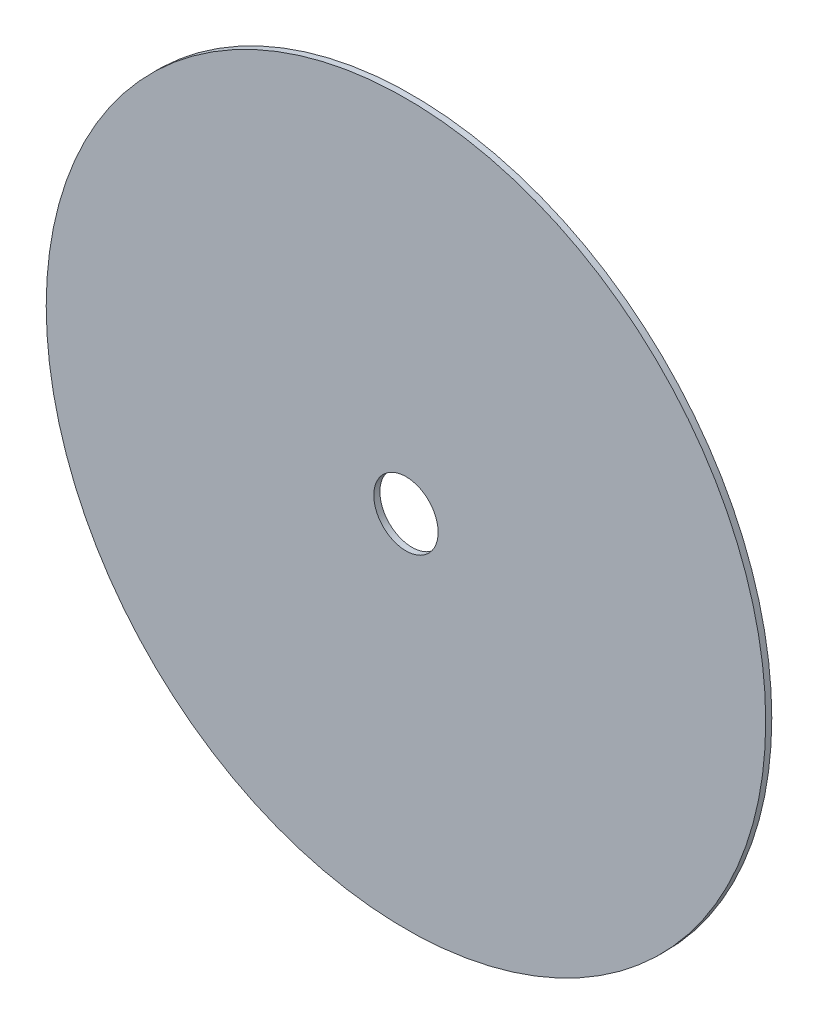
ISO-10303-21;
HEADER;
FILE_DESCRIPTION(('STEP AP214'),'2;1');
FILE_NAME('part.step','',(''),(''),'','','');
FILE_SCHEMA(('AUTOMOTIVE_DESIGN { 1 0 10303 214 1 1 1 1 }'));
ENDSEC;
DATA;
#1=APPLICATION_CONTEXT('core data for automotive mechanical design processes');
#2=APPLICATION_PROTOCOL_DEFINITION('international standard','automotive_design',2000,#1);
#3=PRODUCT_CONTEXT('',#1,'mechanical');
#4=PRODUCT('Part','Part','',(#3));
#5=PRODUCT_RELATED_PRODUCT_CATEGORY('part','',(#4));
#6=PRODUCT_DEFINITION_FORMATION('','',#4);
#7=PRODUCT_DEFINITION_CONTEXT('part definition',#1,'design');
#8=PRODUCT_DEFINITION('design','',#6,#7);
#9=PRODUCT_DEFINITION_SHAPE('','',#8);
#10=(LENGTH_UNIT() NAMED_UNIT(*) SI_UNIT(.MILLI.,.METRE.));
#11=(NAMED_UNIT(*) PLANE_ANGLE_UNIT() SI_UNIT($,.RADIAN.));
#12=(NAMED_UNIT(*) SI_UNIT($,.STERADIAN.) SOLID_ANGLE_UNIT());
#13=UNCERTAINTY_MEASURE_WITH_UNIT(LENGTH_MEASURE(1.E-05),#10,'distance_accuracy_value','');
#14=(GEOMETRIC_REPRESENTATION_CONTEXT(3) GLOBAL_UNCERTAINTY_ASSIGNED_CONTEXT((#13)) GLOBAL_UNIT_ASSIGNED_CONTEXT((#10,
#11,#12)) REPRESENTATION_CONTEXT('',''));
#15=CARTESIAN_POINT('',(0.,0.,0.));
#16=DIRECTION('',(0.,0.,1.));
#17=DIRECTION('',(1.,0.,0.));
#18=AXIS2_PLACEMENT_3D('',#15,#16,#17);
#19=CARTESIAN_POINT('',(0.,0.,3.));
#20=DIRECTION('',(0.,0.,1.));
#21=DIRECTION('',(1.,0.,0.));
#22=AXIS2_PLACEMENT_3D('',#19,#20,#21);
#23=PLANE('',#22);
#24=CARTESIAN_POINT('',(0.,0.,3.));
#25=DIRECTION('',(0.,0.,1.));
#26=DIRECTION('',(1.,0.,0.));
#27=AXIS2_PLACEMENT_3D('',#24,#25,#26);
#28=CIRCLE('',#27,177.8);
#29=CARTESIAN_POINT('',(177.8,0.,3.));
#30=VERTEX_POINT('',#29);
#31=EDGE_CURVE('E10',#30,#30,#28,.T.);
#32=ORIENTED_EDGE('',*,*,#31,.T.);
#33=EDGE_LOOP('',(#32));
#34=FACE_BOUND('',#33,.T.);
#35=CARTESIAN_POINT('',(0.,0.,3.));
#36=DIRECTION('',(0.,0.,1.));
#37=DIRECTION('',(1.,0.,0.));
#38=AXIS2_PLACEMENT_3D('',#35,#36,#37);
#39=CIRCLE('',#38,15.9);
#40=CARTESIAN_POINT('',(15.9,0.,3.));
#41=VERTEX_POINT('',#40);
#42=EDGE_CURVE('E40',#41,#41,#39,.T.);
#43=ORIENTED_EDGE('',*,*,#42,.F.);
#44=EDGE_LOOP('',(#43));
#45=FACE_BOUND('',#44,.T.);
#46=ADVANCED_FACE('F29',(#34,#45),#23,.T.);
#47=CARTESIAN_POINT('',(0.,0.,0.));
#48=DIRECTION('',(0.,0.,1.));
#49=DIRECTION('',(1.,0.,0.));
#50=AXIS2_PLACEMENT_3D('',#47,#48,#49);
#51=PLANE('',#50);
#52=CARTESIAN_POINT('',(0.,0.,0.));
#53=DIRECTION('',(0.,0.,1.));
#54=DIRECTION('',(1.,0.,0.));
#55=AXIS2_PLACEMENT_3D('',#52,#53,#54);
#56=CIRCLE('',#55,177.8);
#57=CARTESIAN_POINT('',(177.8,0.,0.));
#58=VERTEX_POINT('',#57);
#59=EDGE_CURVE('E33',#58,#58,#56,.T.);
#60=ORIENTED_EDGE('',*,*,#59,.F.);
#61=EDGE_LOOP('',(#60));
#62=FACE_BOUND('',#61,.T.);
#63=CARTESIAN_POINT('',(0.,0.,0.));
#64=DIRECTION('',(0.,0.,1.));
#65=DIRECTION('',(1.,0.,0.));
#66=AXIS2_PLACEMENT_3D('',#63,#64,#65);
#67=CIRCLE('',#66,15.9);
#68=CARTESIAN_POINT('',(15.9,0.,0.));
#69=VERTEX_POINT('',#68);
#70=EDGE_CURVE('E42',#69,#69,#67,.T.);
#71=ORIENTED_EDGE('',*,*,#70,.T.);
#72=EDGE_LOOP('',(#71));
#73=FACE_BOUND('',#72,.T.);
#74=ADVANCED_FACE('F52',(#62,#73),#51,.F.);
#75=CARTESIAN_POINT('',(0.,0.,3.));
#76=DIRECTION('',(0.,0.,-1.));
#77=DIRECTION('',(-1.,0.,0.));
#78=AXIS2_PLACEMENT_3D('',#75,#76,#77);
#79=CYLINDRICAL_SURFACE('',#78,177.8);
#80=ORIENTED_EDGE('',*,*,#31,.F.);
#81=EDGE_LOOP('',(#80));
#82=FACE_BOUND('',#81,.T.);
#83=ORIENTED_EDGE('',*,*,#59,.T.);
#84=EDGE_LOOP('',(#83));
#85=FACE_BOUND('',#84,.T.);
#86=ADVANCED_FACE('F31',(#82,#85),#79,.T.);
#87=CARTESIAN_POINT('',(0.,0.,3.));
#88=DIRECTION('',(0.,0.,-1.));
#89=DIRECTION('',(-1.,0.,0.));
#90=AXIS2_PLACEMENT_3D('',#87,#88,#89);
#91=CYLINDRICAL_SURFACE('',#90,15.9);
#92=ORIENTED_EDGE('',*,*,#42,.T.);
#93=EDGE_LOOP('',(#92));
#94=FACE_BOUND('',#93,.T.);
#95=ORIENTED_EDGE('',*,*,#70,.F.);
#96=EDGE_LOOP('',(#95));
#97=FACE_BOUND('',#96,.T.);
#98=ADVANCED_FACE('F48',(#94,#97),#91,.F.);
#99=CLOSED_SHELL('',(#46,#74,#86,#98));
#100=MANIFOLD_SOLID_BREP('B2',#99);
#101=ADVANCED_BREP_SHAPE_REPRESENTATION('',(#18,#100),#14);
#102=SHAPE_DEFINITION_REPRESENTATION(#9,#101);
ENDSEC;
END-ISO-10303-21;
